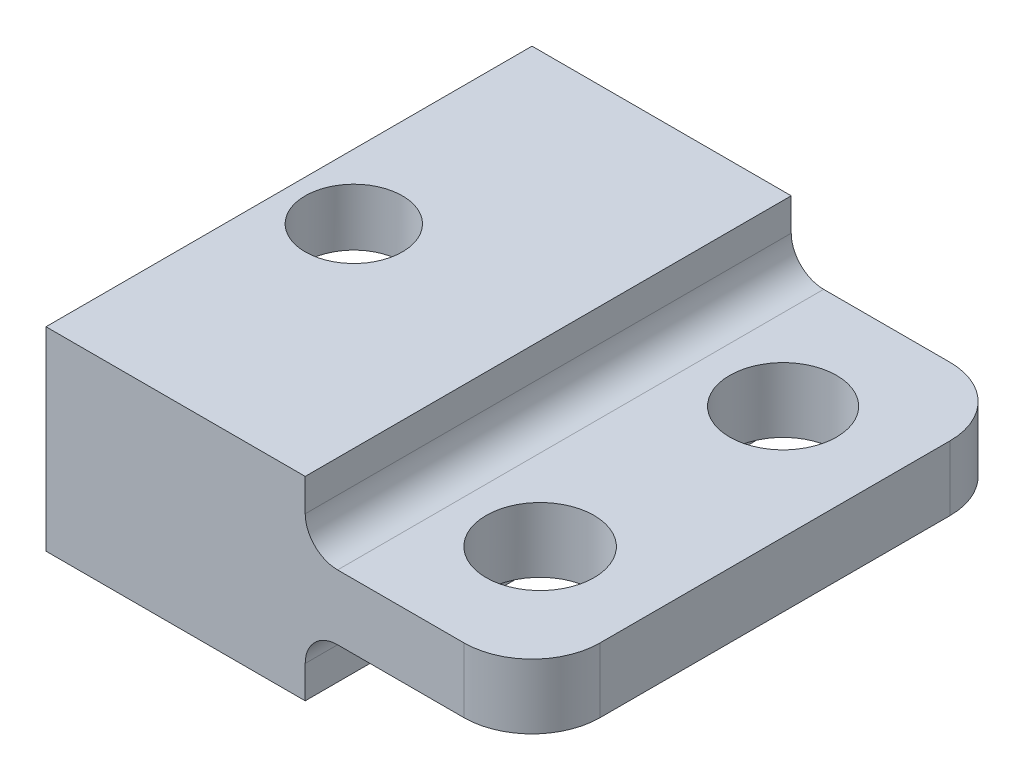
ISO-10303-21;
HEADER;
FILE_DESCRIPTION(('STEP AP214'),'2;1');
FILE_NAME('part.step','',(''),(''),'','','');
FILE_SCHEMA(('AUTOMOTIVE_DESIGN { 1 0 10303 214 1 1 1 1 }'));
ENDSEC;
DATA;
#1=APPLICATION_CONTEXT('core data for automotive mechanical design processes');
#2=APPLICATION_PROTOCOL_DEFINITION('international standard','automotive_design',2000,#1);
#3=PRODUCT_CONTEXT('',#1,'mechanical');
#4=PRODUCT('Part','Part','',(#3));
#5=PRODUCT_RELATED_PRODUCT_CATEGORY('part','',(#4));
#6=PRODUCT_DEFINITION_FORMATION('','',#4);
#7=PRODUCT_DEFINITION_CONTEXT('part definition',#1,'design');
#8=PRODUCT_DEFINITION('design','',#6,#7);
#9=PRODUCT_DEFINITION_SHAPE('','',#8);
#10=(LENGTH_UNIT() NAMED_UNIT(*) SI_UNIT(.MILLI.,.METRE.));
#11=(NAMED_UNIT(*) PLANE_ANGLE_UNIT() SI_UNIT($,.RADIAN.));
#12=(NAMED_UNIT(*) SI_UNIT($,.STERADIAN.) SOLID_ANGLE_UNIT());
#13=UNCERTAINTY_MEASURE_WITH_UNIT(LENGTH_MEASURE(1.E-05),#10,'distance_accuracy_value','');
#14=(GEOMETRIC_REPRESENTATION_CONTEXT(3) GLOBAL_UNCERTAINTY_ASSIGNED_CONTEXT((#13)) GLOBAL_UNIT_ASSIGNED_CONTEXT((#10,
#11,#12)) REPRESENTATION_CONTEXT('',''));
#15=CARTESIAN_POINT('',(0.,0.,0.));
#16=DIRECTION('',(0.,0.,1.));
#17=DIRECTION('',(1.,0.,0.));
#18=AXIS2_PLACEMENT_3D('',#15,#16,#17);
#19=CARTESIAN_POINT('',(-7.,2.,0.));
#20=DIRECTION('',(-1.,0.,0.));
#21=DIRECTION('',(0.,0.,1.));
#22=AXIS2_PLACEMENT_3D('',#19,#20,#21);
#23=PLANE('',#22);
#24=DIRECTION('',(0.,-1.,0.));
#25=VECTOR('',#24,1.);
#26=CARTESIAN_POINT('',(-7.,2.,-15.));
#27=LINE('',#26,#25);
#28=CARTESIAN_POINT('',(-7.,3.99999999999999,-15.));
#29=VERTEX_POINT('',#28);
#30=CARTESIAN_POINT('',(-7.,-2.,-15.));
#31=VERTEX_POINT('',#30);
#32=EDGE_CURVE('E254',#29,#31,#27,.T.);
#33=ORIENTED_EDGE('',*,*,#32,.T.);
#34=DIRECTION('',(0.,0.,-1.));
#35=VECTOR('',#34,1.);
#36=CARTESIAN_POINT('',(-7.,-2.,0.));
#37=LINE('',#36,#35);
#38=CARTESIAN_POINT('',(-7.,-2.,0.));
#39=VERTEX_POINT('',#38);
#40=EDGE_CURVE('E231',#39,#31,#37,.T.);
#41=ORIENTED_EDGE('',*,*,#40,.F.);
#42=DIRECTION('',(0.,-1.,0.));
#43=VECTOR('',#42,1.);
#44=CARTESIAN_POINT('',(-7.,2.,0.));
#45=LINE('',#44,#43);
#46=CARTESIAN_POINT('',(-7.,3.99999999999999,0.));
#47=VERTEX_POINT('',#46);
#48=EDGE_CURVE('E262',#47,#39,#45,.T.);
#49=ORIENTED_EDGE('',*,*,#48,.F.);
#50=DIRECTION('',(0.,0.,1.));
#51=VECTOR('',#50,1.);
#52=CARTESIAN_POINT('',(-7.,3.99999999999999,-15.));
#53=LINE('',#52,#51);
#54=EDGE_CURVE('E213',#29,#47,#53,.T.);
#55=ORIENTED_EDGE('',*,*,#54,.F.);
#56=EDGE_LOOP('',(#33,#41,#49,#55));
#57=FACE_BOUND('',#56,.T.);
#58=DIRECTION('',(0.,0.,1.));
#59=VECTOR('',#58,1.);
#60=CARTESIAN_POINT('',(-7.,-0.763186528502045,0.));
#61=LINE('',#60,#59);
#62=CARTESIAN_POINT('',(-7.,-0.763186528502045,-13.5));
#63=VERTEX_POINT('',#62);
#64=CARTESIAN_POINT('',(-7.,-0.763186528502045,-1.5));
#65=VERTEX_POINT('',#64);
#66=EDGE_CURVE('E189',#63,#65,#61,.T.);
#67=ORIENTED_EDGE('',*,*,#66,.F.);
#68=DIRECTION('',(0.,1.,0.));
#69=VECTOR('',#68,1.);
#70=CARTESIAN_POINT('',(-7.,0.,-13.5));
#71=LINE('',#70,#69);
#72=CARTESIAN_POINT('',(-7.,2.23681347149796,-13.5));
#73=VERTEX_POINT('',#72);
#74=EDGE_CURVE('E156',#63,#73,#71,.T.);
#75=ORIENTED_EDGE('',*,*,#74,.T.);
#76=DIRECTION('',(0.,0.,1.));
#77=VECTOR('',#76,1.);
#78=CARTESIAN_POINT('',(-7.,2.23681347149796,0.));
#79=LINE('',#78,#77);
#80=CARTESIAN_POINT('',(-7.,2.23681347149796,-1.5));
#81=VERTEX_POINT('',#80);
#82=EDGE_CURVE('E161',#73,#81,#79,.T.);
#83=ORIENTED_EDGE('',*,*,#82,.T.);
#84=DIRECTION('',(0.,-1.,0.));
#85=VECTOR('',#84,1.);
#86=CARTESIAN_POINT('',(-7.,0.,-1.5));
#87=LINE('',#86,#85);
#88=EDGE_CURVE('E191',#81,#65,#87,.T.);
#89=ORIENTED_EDGE('',*,*,#88,.T.);
#90=EDGE_LOOP('',(#67,#75,#83,#89));
#91=FACE_BOUND('',#90,.T.);
#92=ADVANCED_FACE('F35',(#57,#91),#23,.T.);
#93=CARTESIAN_POINT('',(0.,2.,0.));
#94=DIRECTION('',(0.,0.,1.));
#95=DIRECTION('',(1.,0.,0.));
#96=AXIS2_PLACEMENT_3D('',#93,#94,#95);
#97=PLANE('',#96);
#98=DIRECTION('',(-1.,0.,0.));
#99=VECTOR('',#98,1.);
#100=CARTESIAN_POINT('',(0.,0.,0.));
#101=LINE('',#100,#99);
#102=CARTESIAN_POINT('',(5.9,0.,0.));
#103=VERTEX_POINT('',#102);
#104=CARTESIAN_POINT('',(2.,0.,0.));
#105=VERTEX_POINT('',#104);
#106=EDGE_CURVE('E244',#103,#105,#101,.T.);
#107=ORIENTED_EDGE('',*,*,#106,.F.);
#108=DIRECTION('',(0.,-1.,0.));
#109=VECTOR('',#108,1.);
#110=CARTESIAN_POINT('',(5.9,2.,0.));
#111=LINE('',#110,#109);
#112=CARTESIAN_POINT('',(5.9,2.,0.));
#113=VERTEX_POINT('',#112);
#114=EDGE_CURVE('E269',#103,#113,#111,.F.);
#115=ORIENTED_EDGE('',*,*,#114,.T.);
#116=DIRECTION('',(-1.,0.,0.));
#117=VECTOR('',#116,1.);
#118=CARTESIAN_POINT('',(0.,2.,0.));
#119=LINE('',#118,#117);
#120=CARTESIAN_POINT('',(2.,2.,0.));
#121=VERTEX_POINT('',#120);
#122=EDGE_CURVE('E247',#113,#121,#119,.T.);
#123=ORIENTED_EDGE('',*,*,#122,.T.);
#124=CARTESIAN_POINT('',(2.,3.,0.));
#125=DIRECTION('',(0.,0.,1.));
#126=DIRECTION('',(1.,0.,0.));
#127=AXIS2_PLACEMENT_3D('',#124,#125,#126);
#128=CIRCLE('',#127,1.);
#129=CARTESIAN_POINT('',(1.,3.,0.));
#130=VERTEX_POINT('',#129);
#131=EDGE_CURVE('E11',#121,#130,#128,.F.);
#132=ORIENTED_EDGE('',*,*,#131,.T.);
#133=DIRECTION('',(0.,-1.,0.));
#134=VECTOR('',#133,1.);
#135=CARTESIAN_POINT('',(1.,3.99999999999999,0.));
#136=LINE('',#135,#134);
#137=CARTESIAN_POINT('',(1.,3.99999999999999,0.));
#138=VERTEX_POINT('',#137);
#139=EDGE_CURVE('E225',#138,#130,#136,.T.);
#140=ORIENTED_EDGE('',*,*,#139,.F.);
#141=DIRECTION('',(1.,0.,0.));
#142=VECTOR('',#141,1.);
#143=CARTESIAN_POINT('',(-7.,3.99999999999999,0.));
#144=LINE('',#143,#142);
#145=EDGE_CURVE('E216',#47,#138,#144,.T.);
#146=ORIENTED_EDGE('',*,*,#145,.F.);
#147=ORIENTED_EDGE('',*,*,#48,.T.);
#148=DIRECTION('',(-1.,0.,0.));
#149=VECTOR('',#148,1.);
#150=CARTESIAN_POINT('',(1.,-2.,0.));
#151=LINE('',#150,#149);
#152=CARTESIAN_POINT('',(1.,-2.,0.));
#153=VERTEX_POINT('',#152);
#154=EDGE_CURVE('E234',#153,#39,#151,.T.);
#155=ORIENTED_EDGE('',*,*,#154,.F.);
#156=DIRECTION('',(0.,1.,0.));
#157=VECTOR('',#156,1.);
#158=CARTESIAN_POINT('',(1.,-2.,0.));
#159=LINE('',#158,#157);
#160=CARTESIAN_POINT('',(1.,-1.,0.));
#161=VERTEX_POINT('',#160);
#162=EDGE_CURVE('E240',#153,#161,#159,.T.);
#163=ORIENTED_EDGE('',*,*,#162,.T.);
#164=CARTESIAN_POINT('',(2.,-1.,0.));
#165=DIRECTION('',(0.,0.,1.));
#166=DIRECTION('',(1.,0.,0.));
#167=AXIS2_PLACEMENT_3D('',#164,#165,#166);
#168=CIRCLE('',#167,1.);
#169=EDGE_CURVE('E292',#161,#105,#168,.F.);
#170=ORIENTED_EDGE('',*,*,#169,.T.);
#171=EDGE_LOOP('',(#107,#115,#123,#132,#140,#146,#147,#155,#163,#170));
#172=FACE_BOUND('',#171,.T.);
#173=ADVANCED_FACE('F317',(#172),#97,.T.);
#174=CARTESIAN_POINT('',(8.,2.,0.));
#175=DIRECTION('',(1.,0.,0.));
#176=DIRECTION('',(0.,0.,-1.));
#177=AXIS2_PLACEMENT_3D('',#174,#175,#176);
#178=PLANE('',#177);
#179=DIRECTION('',(0.,0.,1.));
#180=VECTOR('',#179,1.);
#181=CARTESIAN_POINT('',(8.,0.,0.));
#182=LINE('',#181,#180);
#183=CARTESIAN_POINT('',(8.,0.,-12.9));
#184=VERTEX_POINT('',#183);
#185=CARTESIAN_POINT('',(8.,0.,-2.1));
#186=VERTEX_POINT('',#185);
#187=EDGE_CURVE('E257',#184,#186,#182,.T.);
#188=ORIENTED_EDGE('',*,*,#187,.F.);
#189=DIRECTION('',(0.,-1.,0.));
#190=VECTOR('',#189,1.);
#191=CARTESIAN_POINT('',(8.,2.,-12.9));
#192=LINE('',#191,#190);
#193=CARTESIAN_POINT('',(8.,2.,-12.9));
#194=VERTEX_POINT('',#193);
#195=EDGE_CURVE('E279',#184,#194,#192,.F.);
#196=ORIENTED_EDGE('',*,*,#195,.T.);
#197=DIRECTION('',(0.,0.,1.));
#198=VECTOR('',#197,1.);
#199=CARTESIAN_POINT('',(8.,2.,0.));
#200=LINE('',#199,#198);
#201=CARTESIAN_POINT('',(8.,2.,-2.1));
#202=VERTEX_POINT('',#201);
#203=EDGE_CURVE('E249',#194,#202,#200,.T.);
#204=ORIENTED_EDGE('',*,*,#203,.T.);
#205=DIRECTION('',(0.,-1.,0.));
#206=VECTOR('',#205,1.);
#207=CARTESIAN_POINT('',(8.,2.,-2.1));
#208=LINE('',#207,#206);
#209=EDGE_CURVE('E264',#202,#186,#208,.T.);
#210=ORIENTED_EDGE('',*,*,#209,.T.);
#211=EDGE_LOOP('',(#188,#196,#204,#210));
#212=FACE_BOUND('',#211,.T.);
#213=ADVANCED_FACE('F332',(#212),#178,.T.);
#214=CARTESIAN_POINT('',(0.,2.,-15.));
#215=DIRECTION('',(0.,0.,1.));
#216=DIRECTION('',(1.,0.,0.));
#217=AXIS2_PLACEMENT_3D('',#214,#215,#216);
#218=PLANE('',#217);
#219=DIRECTION('',(-1.,0.,0.));
#220=VECTOR('',#219,1.);
#221=CARTESIAN_POINT('',(0.,2.,-15.));
#222=LINE('',#221,#220);
#223=CARTESIAN_POINT('',(5.9,2.,-15.));
#224=VERTEX_POINT('',#223);
#225=CARTESIAN_POINT('',(2.,2.,-15.));
#226=VERTEX_POINT('',#225);
#227=EDGE_CURVE('E252',#224,#226,#222,.T.);
#228=ORIENTED_EDGE('',*,*,#227,.F.);
#229=DIRECTION('',(0.,-1.,0.));
#230=VECTOR('',#229,1.);
#231=CARTESIAN_POINT('',(5.9,0.,-15.));
#232=LINE('',#231,#230);
#233=CARTESIAN_POINT('',(5.9,0.,-15.));
#234=VERTEX_POINT('',#233);
#235=EDGE_CURVE('E274',#224,#234,#232,.T.);
#236=ORIENTED_EDGE('',*,*,#235,.T.);
#237=DIRECTION('',(-1.,0.,0.));
#238=VECTOR('',#237,1.);
#239=CARTESIAN_POINT('',(0.,0.,-15.));
#240=LINE('',#239,#238);
#241=CARTESIAN_POINT('',(2.,0.,-15.));
#242=VERTEX_POINT('',#241);
#243=EDGE_CURVE('E250',#234,#242,#240,.T.);
#244=ORIENTED_EDGE('',*,*,#243,.T.);
#245=CARTESIAN_POINT('',(2.,-1.,-15.));
#246=DIRECTION('',(0.,0.,1.));
#247=DIRECTION('',(1.,0.,0.));
#248=AXIS2_PLACEMENT_3D('',#245,#246,#247);
#249=CIRCLE('',#248,1.);
#250=CARTESIAN_POINT('',(1.,-1.,-15.));
#251=VERTEX_POINT('',#250);
#252=EDGE_CURVE('E290',#242,#251,#249,.T.);
#253=ORIENTED_EDGE('',*,*,#252,.T.);
#254=DIRECTION('',(0.,1.,0.));
#255=VECTOR('',#254,1.);
#256=CARTESIAN_POINT('',(1.,-2.,-15.));
#257=LINE('',#256,#255);
#258=CARTESIAN_POINT('',(1.,-2.,-15.));
#259=VERTEX_POINT('',#258);
#260=EDGE_CURVE('E241',#259,#251,#257,.T.);
#261=ORIENTED_EDGE('',*,*,#260,.F.);
#262=DIRECTION('',(-1.,0.,0.));
#263=VECTOR('',#262,1.);
#264=CARTESIAN_POINT('',(1.,-2.,-15.));
#265=LINE('',#264,#263);
#266=EDGE_CURVE('E228',#259,#31,#265,.T.);
#267=ORIENTED_EDGE('',*,*,#266,.T.);
#268=ORIENTED_EDGE('',*,*,#32,.F.);
#269=DIRECTION('',(-1.,0.,0.));
#270=VECTOR('',#269,1.);
#271=CARTESIAN_POINT('',(-7.,3.99999999999999,-15.));
#272=LINE('',#271,#270);
#273=CARTESIAN_POINT('',(1.,3.99999999999999,-15.));
#274=VERTEX_POINT('',#273);
#275=EDGE_CURVE('E220',#274,#29,#272,.T.);
#276=ORIENTED_EDGE('',*,*,#275,.F.);
#277=DIRECTION('',(0.,-1.,0.));
#278=VECTOR('',#277,1.);
#279=CARTESIAN_POINT('',(1.,3.99999999999999,-15.));
#280=LINE('',#279,#278);
#281=CARTESIAN_POINT('',(1.,3.,-15.));
#282=VERTEX_POINT('',#281);
#283=EDGE_CURVE('E223',#274,#282,#280,.T.);
#284=ORIENTED_EDGE('',*,*,#283,.T.);
#285=CARTESIAN_POINT('',(2.,3.,-15.));
#286=DIRECTION('',(0.,0.,1.));
#287=DIRECTION('',(1.,0.,0.));
#288=AXIS2_PLACEMENT_3D('',#285,#286,#287);
#289=CIRCLE('',#288,1.);
#290=EDGE_CURVE('E43',#282,#226,#289,.T.);
#291=ORIENTED_EDGE('',*,*,#290,.T.);
#292=EDGE_LOOP('',(#228,#236,#244,#253,#261,#267,#268,#276,#284,#291));
#293=FACE_BOUND('',#292,.T.);
#294=ADVANCED_FACE('F306',(#293),#218,.F.);
#295=CARTESIAN_POINT('',(0.,2.,0.));
#296=DIRECTION('',(0.,1.,0.));
#297=DIRECTION('',(0.,0.,1.));
#298=AXIS2_PLACEMENT_3D('',#295,#296,#297);
#299=PLANE('',#298);
#300=CARTESIAN_POINT('',(4.5,2.,-3.75));
#301=DIRECTION('',(0.,1.,0.));
#302=DIRECTION('',(0.,0.,1.));
#303=AXIS2_PLACEMENT_3D('',#300,#301,#302);
#304=CIRCLE('',#303,1.665);
#305=CARTESIAN_POINT('',(4.5,2.,-2.085));
#306=VERTEX_POINT('',#305);
#307=EDGE_CURVE('E210',#306,#306,#304,.T.);
#308=ORIENTED_EDGE('',*,*,#307,.F.);
#309=EDGE_LOOP('',(#308));
#310=FACE_BOUND('',#309,.T.);
#311=CARTESIAN_POINT('',(4.5,2.,-11.25));
#312=DIRECTION('',(0.,1.,0.));
#313=DIRECTION('',(0.,0.,1.));
#314=AXIS2_PLACEMENT_3D('',#311,#312,#313);
#315=CIRCLE('',#314,1.65);
#316=CARTESIAN_POINT('',(4.5,2.,-9.6));
#317=VERTEX_POINT('',#316);
#318=EDGE_CURVE('E205',#317,#317,#315,.T.);
#319=ORIENTED_EDGE('',*,*,#318,.F.);
#320=EDGE_LOOP('',(#319));
#321=FACE_BOUND('',#320,.T.);
#322=ORIENTED_EDGE('',*,*,#227,.T.);
#323=DIRECTION('',(0.,0.,-1.));
#324=VECTOR('',#323,1.);
#325=CARTESIAN_POINT('',(2.,2.,0.));
#326=LINE('',#325,#324);
#327=EDGE_CURVE('E50',#226,#121,#326,.F.);
#328=ORIENTED_EDGE('',*,*,#327,.T.);
#329=ORIENTED_EDGE('',*,*,#122,.F.);
#330=CARTESIAN_POINT('',(5.9,2.,-2.1));
#331=DIRECTION('',(0.,1.,0.));
#332=DIRECTION('',(0.,0.,1.));
#333=AXIS2_PLACEMENT_3D('',#330,#331,#332);
#334=CIRCLE('',#333,2.1);
#335=EDGE_CURVE('E271',#113,#202,#334,.T.);
#336=ORIENTED_EDGE('',*,*,#335,.T.);
#337=ORIENTED_EDGE('',*,*,#203,.F.);
#338=CARTESIAN_POINT('',(5.9,2.,-12.9));
#339=DIRECTION('',(0.,1.,0.));
#340=DIRECTION('',(0.,0.,1.));
#341=AXIS2_PLACEMENT_3D('',#338,#339,#340);
#342=CIRCLE('',#341,2.1);
#343=EDGE_CURVE('E281',#194,#224,#342,.T.);
#344=ORIENTED_EDGE('',*,*,#343,.T.);
#345=EDGE_LOOP('',(#322,#328,#329,#336,#337,#344));
#346=FACE_BOUND('',#345,.T.);
#347=ADVANCED_FACE('F353',(#310,#321,#346),#299,.T.);
#348=CARTESIAN_POINT('',(0.,0.,0.));
#349=DIRECTION('',(0.,1.,0.));
#350=DIRECTION('',(0.,0.,1.));
#351=AXIS2_PLACEMENT_3D('',#348,#349,#350);
#352=PLANE('',#351);
#353=CARTESIAN_POINT('',(4.5,0.,-3.75));
#354=DIRECTION('',(0.,-1.,0.));
#355=DIRECTION('',(0.,0.,-1.));
#356=AXIS2_PLACEMENT_3D('',#353,#354,#355);
#357=CIRCLE('',#356,1.665);
#358=CARTESIAN_POINT('',(4.5,0.,-5.415));
#359=VERTEX_POINT('',#358);
#360=EDGE_CURVE('E202',#359,#359,#357,.T.);
#361=ORIENTED_EDGE('',*,*,#360,.F.);
#362=EDGE_LOOP('',(#361));
#363=FACE_BOUND('',#362,.T.);
#364=CARTESIAN_POINT('',(4.5,0.,-11.25));
#365=DIRECTION('',(0.,-1.,0.));
#366=DIRECTION('',(0.,0.,-1.));
#367=AXIS2_PLACEMENT_3D('',#364,#365,#366);
#368=CIRCLE('',#367,1.65);
#369=CARTESIAN_POINT('',(4.5,0.,-12.9));
#370=VERTEX_POINT('',#369);
#371=EDGE_CURVE('E198',#370,#370,#368,.T.);
#372=ORIENTED_EDGE('',*,*,#371,.F.);
#373=EDGE_LOOP('',(#372));
#374=FACE_BOUND('',#373,.T.);
#375=ORIENTED_EDGE('',*,*,#106,.T.);
#376=DIRECTION('',(0.,0.,-1.));
#377=VECTOR('',#376,1.);
#378=CARTESIAN_POINT('',(2.,0.,0.));
#379=LINE('',#378,#377);
#380=EDGE_CURVE('E283',#105,#242,#379,.T.);
#381=ORIENTED_EDGE('',*,*,#380,.T.);
#382=ORIENTED_EDGE('',*,*,#243,.F.);
#383=CARTESIAN_POINT('',(5.9,0.,-12.9));
#384=DIRECTION('',(0.,1.,0.));
#385=DIRECTION('',(0.,0.,1.));
#386=AXIS2_PLACEMENT_3D('',#383,#384,#385);
#387=CIRCLE('',#386,2.1);
#388=EDGE_CURVE('E277',#234,#184,#387,.F.);
#389=ORIENTED_EDGE('',*,*,#388,.T.);
#390=ORIENTED_EDGE('',*,*,#187,.T.);
#391=CARTESIAN_POINT('',(5.9,0.,-2.1));
#392=DIRECTION('',(0.,1.,0.));
#393=DIRECTION('',(0.,0.,1.));
#394=AXIS2_PLACEMENT_3D('',#391,#392,#393);
#395=CIRCLE('',#394,2.1);
#396=EDGE_CURVE('E267',#186,#103,#395,.F.);
#397=ORIENTED_EDGE('',*,*,#396,.T.);
#398=EDGE_LOOP('',(#375,#381,#382,#389,#390,#397));
#399=FACE_BOUND('',#398,.T.);
#400=ADVANCED_FACE('F356',(#363,#374,#399),#352,.F.);
#401=CARTESIAN_POINT('',(1.,-2.,0.));
#402=DIRECTION('',(1.,0.,0.));
#403=DIRECTION('',(0.,0.,-1.));
#404=AXIS2_PLACEMENT_3D('',#401,#402,#403);
#405=PLANE('',#404);
#406=ORIENTED_EDGE('',*,*,#260,.T.);
#407=DIRECTION('',(0.,0.,-1.));
#408=VECTOR('',#407,1.);
#409=CARTESIAN_POINT('',(1.,-1.,0.));
#410=LINE('',#409,#408);
#411=EDGE_CURVE('E288',#251,#161,#410,.F.);
#412=ORIENTED_EDGE('',*,*,#411,.T.);
#413=ORIENTED_EDGE('',*,*,#162,.F.);
#414=DIRECTION('',(0.,0.,-1.));
#415=VECTOR('',#414,1.);
#416=CARTESIAN_POINT('',(1.,-2.,0.));
#417=LINE('',#416,#415);
#418=EDGE_CURVE('E237',#153,#259,#417,.T.);
#419=ORIENTED_EDGE('',*,*,#418,.T.);
#420=EDGE_LOOP('',(#406,#412,#413,#419));
#421=FACE_BOUND('',#420,.T.);
#422=ADVANCED_FACE('F363',(#421),#405,.T.);
#423=CARTESIAN_POINT('',(0.,-2.,0.));
#424=DIRECTION('',(0.,-1.,0.));
#425=DIRECTION('',(0.,0.,-1.));
#426=AXIS2_PLACEMENT_3D('',#423,#424,#425);
#427=PLANE('',#426);
#428=CARTESIAN_POINT('',(-5.,-2.,-7.5));
#429=DIRECTION('',(0.,-1.,0.));
#430=DIRECTION('',(0.,0.,-1.));
#431=AXIS2_PLACEMENT_3D('',#428,#429,#430);
#432=CIRCLE('',#431,1.5);
#433=CARTESIAN_POINT('',(-5.,-2.,-9.));
#434=VERTEX_POINT('',#433);
#435=EDGE_CURVE('E185',#434,#434,#432,.T.);
#436=ORIENTED_EDGE('',*,*,#435,.F.);
#437=EDGE_LOOP('',(#436));
#438=FACE_BOUND('',#437,.T.);
#439=ORIENTED_EDGE('',*,*,#266,.F.);
#440=ORIENTED_EDGE('',*,*,#418,.F.);
#441=ORIENTED_EDGE('',*,*,#154,.T.);
#442=ORIENTED_EDGE('',*,*,#40,.T.);
#443=EDGE_LOOP('',(#439,#440,#441,#442));
#444=FACE_BOUND('',#443,.T.);
#445=ADVANCED_FACE('F366',(#438,#444),#427,.T.);
#446=CARTESIAN_POINT('',(1.,3.99999999999999,-15.));
#447=DIRECTION('',(-1.,0.,0.));
#448=DIRECTION('',(0.,0.,1.));
#449=AXIS2_PLACEMENT_3D('',#446,#447,#448);
#450=PLANE('',#449);
#451=ORIENTED_EDGE('',*,*,#139,.T.);
#452=DIRECTION('',(0.,0.,-1.));
#453=VECTOR('',#452,1.);
#454=CARTESIAN_POINT('',(1.,3.,-15.));
#455=LINE('',#454,#453);
#456=EDGE_CURVE('E294',#130,#282,#455,.T.);
#457=ORIENTED_EDGE('',*,*,#456,.T.);
#458=ORIENTED_EDGE('',*,*,#283,.F.);
#459=DIRECTION('',(0.,0.,-1.));
#460=VECTOR('',#459,1.);
#461=CARTESIAN_POINT('',(1.,3.99999999999999,-15.));
#462=LINE('',#461,#460);
#463=EDGE_CURVE('E218',#138,#274,#462,.T.);
#464=ORIENTED_EDGE('',*,*,#463,.F.);
#465=EDGE_LOOP('',(#451,#457,#458,#464));
#466=FACE_BOUND('',#465,.T.);
#467=ADVANCED_FACE('F300',(#466),#450,.F.);
#468=CARTESIAN_POINT('',(0.,3.99999999999999,0.));
#469=DIRECTION('',(0.,1.,0.));
#470=DIRECTION('',(0.,0.,1.));
#471=AXIS2_PLACEMENT_3D('',#468,#469,#470);
#472=PLANE('',#471);
#473=CARTESIAN_POINT('',(-5.,3.99999999999999,-7.5));
#474=DIRECTION('',(0.,1.,0.));
#475=DIRECTION('',(0.,0.,1.));
#476=AXIS2_PLACEMENT_3D('',#473,#474,#475);
#477=CIRCLE('',#476,1.5);
#478=CARTESIAN_POINT('',(-5.,3.99999999999999,-6.));
#479=VERTEX_POINT('',#478);
#480=EDGE_CURVE('E178',#479,#479,#477,.T.);
#481=ORIENTED_EDGE('',*,*,#480,.F.);
#482=EDGE_LOOP('',(#481));
#483=FACE_BOUND('',#482,.T.);
#484=ORIENTED_EDGE('',*,*,#54,.T.);
#485=ORIENTED_EDGE('',*,*,#145,.T.);
#486=ORIENTED_EDGE('',*,*,#463,.T.);
#487=ORIENTED_EDGE('',*,*,#275,.T.);
#488=EDGE_LOOP('',(#484,#485,#486,#487));
#489=FACE_BOUND('',#488,.T.);
#490=ADVANCED_FACE('F309',(#483,#489),#472,.T.);
#491=CARTESIAN_POINT('',(4.5,9.,-11.25));
#492=DIRECTION('',(0.,-1.,0.));
#493=DIRECTION('',(0.,0.,-1.));
#494=AXIS2_PLACEMENT_3D('',#491,#492,#493);
#495=CYLINDRICAL_SURFACE('',#494,1.65);
#496=ORIENTED_EDGE('',*,*,#318,.T.);
#497=EDGE_LOOP('',(#496));
#498=FACE_BOUND('',#497,.T.);
#499=ORIENTED_EDGE('',*,*,#371,.T.);
#500=EDGE_LOOP('',(#499));
#501=FACE_BOUND('',#500,.T.);
#502=ADVANCED_FACE('F393',(#498,#501),#495,.F.);
#503=CARTESIAN_POINT('',(4.5,9.,-3.75));
#504=DIRECTION('',(0.,-1.,0.));
#505=DIRECTION('',(0.,0.,-1.));
#506=AXIS2_PLACEMENT_3D('',#503,#504,#505);
#507=CYLINDRICAL_SURFACE('',#506,1.665);
#508=ORIENTED_EDGE('',*,*,#307,.T.);
#509=EDGE_LOOP('',(#508));
#510=FACE_BOUND('',#509,.T.);
#511=ORIENTED_EDGE('',*,*,#360,.T.);
#512=EDGE_LOOP('',(#511));
#513=FACE_BOUND('',#512,.T.);
#514=ADVANCED_FACE('F340',(#510,#513),#507,.F.);
#515=CARTESIAN_POINT('',(5.9,2.,-2.1));
#516=DIRECTION('',(0.,-1.,0.));
#517=DIRECTION('',(0.,0.,-1.));
#518=AXIS2_PLACEMENT_3D('',#515,#516,#517);
#519=CYLINDRICAL_SURFACE('',#518,2.1);
#520=ORIENTED_EDGE('',*,*,#335,.F.);
#521=ORIENTED_EDGE('',*,*,#114,.F.);
#522=ORIENTED_EDGE('',*,*,#396,.F.);
#523=ORIENTED_EDGE('',*,*,#209,.F.);
#524=EDGE_LOOP('',(#520,#521,#522,#523));
#525=FACE_BOUND('',#524,.T.);
#526=ADVANCED_FACE('F336',(#525),#519,.T.);
#527=CARTESIAN_POINT('',(5.9,2.,-12.9));
#528=DIRECTION('',(0.,1.,0.));
#529=DIRECTION('',(0.,0.,1.));
#530=AXIS2_PLACEMENT_3D('',#527,#528,#529);
#531=CYLINDRICAL_SURFACE('',#530,2.1);
#532=ORIENTED_EDGE('',*,*,#343,.F.);
#533=ORIENTED_EDGE('',*,*,#195,.F.);
#534=ORIENTED_EDGE('',*,*,#388,.F.);
#535=ORIENTED_EDGE('',*,*,#235,.F.);
#536=EDGE_LOOP('',(#532,#533,#534,#535));
#537=FACE_BOUND('',#536,.T.);
#538=ADVANCED_FACE('F339',(#537),#531,.T.);
#539=CARTESIAN_POINT('',(-3.2,0.,-13.5));
#540=DIRECTION('',(0.,0.,1.));
#541=DIRECTION('',(1.,0.,0.));
#542=AXIS2_PLACEMENT_3D('',#539,#540,#541);
#543=PLANE('',#542);
#544=ORIENTED_EDGE('',*,*,#74,.F.);
#545=DIRECTION('',(-1.,0.,0.));
#546=VECTOR('',#545,1.);
#547=CARTESIAN_POINT('',(-3.2,-0.763186528502045,-13.5));
#548=LINE('',#547,#546);
#549=CARTESIAN_POINT('',(-3.,-0.763186528502045,-13.5));
#550=VERTEX_POINT('',#549);
#551=EDGE_CURVE('E148',#550,#63,#548,.T.);
#552=ORIENTED_EDGE('',*,*,#551,.F.);
#553=DIRECTION('',(0.,-1.,0.));
#554=VECTOR('',#553,1.);
#555=CARTESIAN_POINT('',(-3.,-0.763186528502045,-13.5));
#556=LINE('',#555,#554);
#557=CARTESIAN_POINT('',(-3.,2.23681347149796,-13.5));
#558=VERTEX_POINT('',#557);
#559=EDGE_CURVE('E153',#558,#550,#556,.T.);
#560=ORIENTED_EDGE('',*,*,#559,.F.);
#561=DIRECTION('',(-1.,0.,0.));
#562=VECTOR('',#561,1.);
#563=CARTESIAN_POINT('',(-3.2,2.23681347149796,-13.5));
#564=LINE('',#563,#562);
#565=EDGE_CURVE('E196',#558,#73,#564,.T.);
#566=ORIENTED_EDGE('',*,*,#565,.T.);
#567=EDGE_LOOP('',(#544,#552,#560,#566));
#568=FACE_BOUND('',#567,.T.);
#569=ADVANCED_FACE('F150',(#568),#543,.T.);
#570=CARTESIAN_POINT('',(-3.2,2.23681347149796,0.));
#571=DIRECTION('',(0.,-1.,0.));
#572=DIRECTION('',(0.,0.,-1.));
#573=AXIS2_PLACEMENT_3D('',#570,#571,#572);
#574=PLANE('',#573);
#575=CARTESIAN_POINT('',(-5.,2.23681347149796,-7.5));
#576=DIRECTION('',(0.,-1.,0.));
#577=DIRECTION('',(0.,0.,-1.));
#578=AXIS2_PLACEMENT_3D('',#575,#576,#577);
#579=CIRCLE('',#578,1.5);
#580=CARTESIAN_POINT('',(-5.,2.23681347149796,-9.));
#581=VERTEX_POINT('',#580);
#582=EDGE_CURVE('E182',#581,#581,#579,.T.);
#583=ORIENTED_EDGE('',*,*,#582,.F.);
#584=EDGE_LOOP('',(#583));
#585=FACE_BOUND('',#584,.T.);
#586=ORIENTED_EDGE('',*,*,#82,.F.);
#587=ORIENTED_EDGE('',*,*,#565,.F.);
#588=DIRECTION('',(0.,0.,-1.));
#589=VECTOR('',#588,1.);
#590=CARTESIAN_POINT('',(-3.,2.23681347149796,-13.5));
#591=LINE('',#590,#589);
#592=CARTESIAN_POINT('',(-3.,2.23681347149796,-1.5));
#593=VERTEX_POINT('',#592);
#594=EDGE_CURVE('E173',#593,#558,#591,.T.);
#595=ORIENTED_EDGE('',*,*,#594,.F.);
#596=DIRECTION('',(-1.,0.,0.));
#597=VECTOR('',#596,1.);
#598=CARTESIAN_POINT('',(-3.2,2.23681347149796,-1.5));
#599=LINE('',#598,#597);
#600=EDGE_CURVE('E199',#593,#81,#599,.T.);
#601=ORIENTED_EDGE('',*,*,#600,.T.);
#602=EDGE_LOOP('',(#586,#587,#595,#601));
#603=FACE_BOUND('',#602,.T.);
#604=ADVANCED_FACE('F347',(#585,#603),#574,.T.);
#605=CARTESIAN_POINT('',(-3.2,0.,-1.5));
#606=DIRECTION('',(0.,0.,-1.));
#607=DIRECTION('',(0.,1.,0.));
#608=AXIS2_PLACEMENT_3D('',#605,#606,#607);
#609=PLANE('',#608);
#610=ORIENTED_EDGE('',*,*,#88,.F.);
#611=ORIENTED_EDGE('',*,*,#600,.F.);
#612=DIRECTION('',(0.,1.,0.));
#613=VECTOR('',#612,1.);
#614=CARTESIAN_POINT('',(-3.,-0.763186528502045,-1.5));
#615=LINE('',#614,#613);
#616=CARTESIAN_POINT('',(-3.,-0.763186528502045,-1.5));
#617=VERTEX_POINT('',#616);
#618=EDGE_CURVE('E169',#617,#593,#615,.T.);
#619=ORIENTED_EDGE('',*,*,#618,.F.);
#620=DIRECTION('',(-1.,0.,0.));
#621=VECTOR('',#620,1.);
#622=CARTESIAN_POINT('',(-3.2,-0.763186528502045,-1.5));
#623=LINE('',#622,#621);
#624=EDGE_CURVE('E160',#617,#65,#623,.T.);
#625=ORIENTED_EDGE('',*,*,#624,.T.);
#626=EDGE_LOOP('',(#610,#611,#619,#625));
#627=FACE_BOUND('',#626,.T.);
#628=ADVANCED_FACE('F404',(#627),#609,.T.);
#629=CARTESIAN_POINT('',(-3.2,-0.763186528502045,0.));
#630=DIRECTION('',(0.,-1.,0.));
#631=DIRECTION('',(0.,0.,-1.));
#632=AXIS2_PLACEMENT_3D('',#629,#630,#631);
#633=PLANE('',#632);
#634=CARTESIAN_POINT('',(-5.,-0.763186528502045,-7.5));
#635=DIRECTION('',(0.,-1.,0.));
#636=DIRECTION('',(0.,0.,-1.));
#637=AXIS2_PLACEMENT_3D('',#634,#635,#636);
#638=CIRCLE('',#637,1.5);
#639=CARTESIAN_POINT('',(-5.,-0.763186528502045,-9.));
#640=VERTEX_POINT('',#639);
#641=EDGE_CURVE('E181',#640,#640,#638,.T.);
#642=ORIENTED_EDGE('',*,*,#641,.T.);
#643=EDGE_LOOP('',(#642));
#644=FACE_BOUND('',#643,.T.);
#645=ORIENTED_EDGE('',*,*,#66,.T.);
#646=ORIENTED_EDGE('',*,*,#624,.F.);
#647=DIRECTION('',(0.,0.,1.));
#648=VECTOR('',#647,1.);
#649=CARTESIAN_POINT('',(-3.,-0.763186528502045,-13.5));
#650=LINE('',#649,#648);
#651=EDGE_CURVE('E164',#550,#617,#650,.T.);
#652=ORIENTED_EDGE('',*,*,#651,.F.);
#653=ORIENTED_EDGE('',*,*,#551,.T.);
#654=EDGE_LOOP('',(#645,#646,#652,#653));
#655=FACE_BOUND('',#654,.T.);
#656=ADVANCED_FACE('F165',(#644,#655),#633,.F.);
#657=CARTESIAN_POINT('',(-5.,-13.2,-7.5));
#658=DIRECTION('',(0.,1.,0.));
#659=DIRECTION('',(0.,0.,1.));
#660=AXIS2_PLACEMENT_3D('',#657,#658,#659);
#661=CYLINDRICAL_SURFACE('',#660,1.5);
#662=ORIENTED_EDGE('',*,*,#435,.T.);
#663=EDGE_LOOP('',(#662));
#664=FACE_BOUND('',#663,.T.);
#665=ORIENTED_EDGE('',*,*,#641,.F.);
#666=EDGE_LOOP('',(#665));
#667=FACE_BOUND('',#666,.T.);
#668=ADVANCED_FACE('F403',(#664,#667),#661,.F.);
#669=ORIENTED_EDGE('',*,*,#582,.T.);
#670=EDGE_LOOP('',(#669));
#671=FACE_BOUND('',#670,.T.);
#672=ORIENTED_EDGE('',*,*,#480,.T.);
#673=EDGE_LOOP('',(#672));
#674=FACE_BOUND('',#673,.T.);
#675=ADVANCED_FACE('F325',(#671,#674),#661,.F.);
#676=CARTESIAN_POINT('',(2.,-1.,0.));
#677=DIRECTION('',(0.,0.,-1.));
#678=DIRECTION('',(-1.,0.,0.));
#679=AXIS2_PLACEMENT_3D('',#676,#677,#678);
#680=CYLINDRICAL_SURFACE('',#679,1.);
#681=ORIENTED_EDGE('',*,*,#169,.F.);
#682=ORIENTED_EDGE('',*,*,#411,.F.);
#683=ORIENTED_EDGE('',*,*,#252,.F.);
#684=ORIENTED_EDGE('',*,*,#380,.F.);
#685=EDGE_LOOP('',(#681,#682,#683,#684));
#686=FACE_BOUND('',#685,.T.);
#687=ADVANCED_FACE('F319',(#686),#680,.F.);
#688=CARTESIAN_POINT('',(2.,3.,-15.));
#689=DIRECTION('',(0.,0.,-1.));
#690=DIRECTION('',(-1.,0.,0.));
#691=AXIS2_PLACEMENT_3D('',#688,#689,#690);
#692=CYLINDRICAL_SURFACE('',#691,1.);
#693=ORIENTED_EDGE('',*,*,#131,.F.);
#694=ORIENTED_EDGE('',*,*,#327,.F.);
#695=ORIENTED_EDGE('',*,*,#290,.F.);
#696=ORIENTED_EDGE('',*,*,#456,.F.);
#697=EDGE_LOOP('',(#693,#694,#695,#696));
#698=FACE_BOUND('',#697,.T.);
#699=ADVANCED_FACE('F37',(#698),#692,.F.);
#700=CARTESIAN_POINT('',(-3.,0.,0.));
#701=DIRECTION('',(1.,0.,0.));
#702=DIRECTION('',(0.,0.,-1.));
#703=AXIS2_PLACEMENT_3D('',#700,#701,#702);
#704=PLANE('',#703);
#705=ORIENTED_EDGE('',*,*,#559,.T.);
#706=ORIENTED_EDGE('',*,*,#651,.T.);
#707=ORIENTED_EDGE('',*,*,#618,.T.);
#708=ORIENTED_EDGE('',*,*,#594,.T.);
#709=EDGE_LOOP('',(#705,#706,#707,#708));
#710=FACE_BOUND('',#709,.T.);
#711=ADVANCED_FACE('F171',(#710),#704,.F.);
#712=CLOSED_SHELL('',(#92,#173,#213,#294,#347,#400,#422,#445,#467,#490,#502,#514,#526,#538,#569,
#604,#628,#656,#668,#675,#687,#699,#711));
#713=MANIFOLD_SOLID_BREP('B2',#712);
#714=ADVANCED_BREP_SHAPE_REPRESENTATION('',(#18,#713),#14);
#715=SHAPE_DEFINITION_REPRESENTATION(#9,#714);
ENDSEC;
END-ISO-10303-21;
